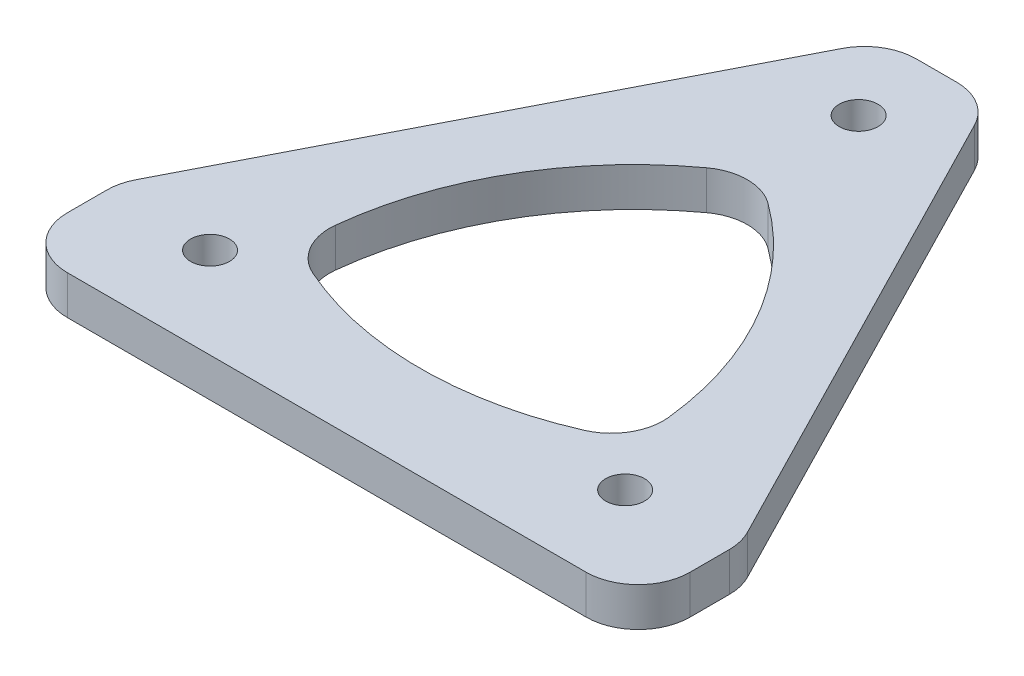
ISO-10303-21;
HEADER;
FILE_DESCRIPTION(('STEP AP214'),'2;1');
FILE_NAME('part.step','',(''),(''),'','','');
FILE_SCHEMA(('AUTOMOTIVE_DESIGN { 1 0 10303 214 1 1 1 1 }'));
ENDSEC;
DATA;
#1=APPLICATION_CONTEXT('core data for automotive mechanical design processes');
#2=APPLICATION_PROTOCOL_DEFINITION('international standard','automotive_design',2000,#1);
#3=PRODUCT_CONTEXT('',#1,'mechanical');
#4=PRODUCT('Part','Part','',(#3));
#5=PRODUCT_RELATED_PRODUCT_CATEGORY('part','',(#4));
#6=PRODUCT_DEFINITION_FORMATION('','',#4);
#7=PRODUCT_DEFINITION_CONTEXT('part definition',#1,'design');
#8=PRODUCT_DEFINITION('design','',#6,#7);
#9=PRODUCT_DEFINITION_SHAPE('','',#8);
#10=(LENGTH_UNIT() NAMED_UNIT(*) SI_UNIT(.MILLI.,.METRE.));
#11=(NAMED_UNIT(*) PLANE_ANGLE_UNIT() SI_UNIT($,.RADIAN.));
#12=(NAMED_UNIT(*) SI_UNIT($,.STERADIAN.) SOLID_ANGLE_UNIT());
#13=UNCERTAINTY_MEASURE_WITH_UNIT(LENGTH_MEASURE(1.E-05),#10,'distance_accuracy_value','');
#14=(GEOMETRIC_REPRESENTATION_CONTEXT(3) GLOBAL_UNCERTAINTY_ASSIGNED_CONTEXT((#13)) GLOBAL_UNIT_ASSIGNED_CONTEXT((#10,
#11,#12)) REPRESENTATION_CONTEXT('',''));
#15=CARTESIAN_POINT('',(0.,0.,0.));
#16=DIRECTION('',(0.,0.,1.));
#17=DIRECTION('',(1.,0.,0.));
#18=AXIS2_PLACEMENT_3D('',#15,#16,#17);
#19=CARTESIAN_POINT('',(-20.,3.,-4.));
#20=DIRECTION('',(0.,-1.,0.));
#21=DIRECTION('',(0.,0.,-1.));
#22=AXIS2_PLACEMENT_3D('',#19,#20,#21);
#23=PLANE('',#22);
#24=CARTESIAN_POINT('',(0.,3.,-33.1908532848341));
#25=DIRECTION('',(0.,1.,0.));
#26=DIRECTION('',(0.,0.,1.));
#27=AXIS2_PLACEMENT_3D('',#24,#25,#26);
#28=CIRCLE('',#27,25.9807621135332);
#29=CARTESIAN_POINT('',(-10.4731291784257,3.,-9.41452965791463));
#30=VERTEX_POINT('',#29);
#31=CARTESIAN_POINT('',(10.4731291784257,3.,-9.41452965791463));
#32=VERTEX_POINT('',#31);
#33=EDGE_CURVE('E227',#30,#32,#28,.T.);
#34=ORIENTED_EDGE('',*,*,#33,.F.);
#35=CARTESIAN_POINT('',(-8.86068545831319,3.,-13.0751341502724));
#36=DIRECTION('',(0.,-1.,0.));
#37=DIRECTION('',(0.,0.,-1.));
#38=AXIS2_PLACEMENT_3D('',#35,#36,#37);
#39=CIRCLE('',#38,4.);
#40=CARTESIAN_POINT('',(-12.8370838019587,3.,-13.5090191726612));
#41=VERTEX_POINT('',#40);
#42=EDGE_CURVE('E209',#30,#41,#39,.T.);
#43=ORIENTED_EDGE('',*,*,#42,.T.);
#44=CARTESIAN_POINT('',(12.9903810567666,3.,-10.6908532848341));
#45=DIRECTION('',(0.,1.,0.));
#46=DIRECTION('',(0.,0.,1.));
#47=AXIS2_PLACEMENT_3D('',#44,#45,#46);
#48=CIRCLE('',#47,25.9807621135332);
#49=CARTESIAN_POINT('',(-2.36395462353303,3.,-31.6490110239265));
#50=VERTEX_POINT('',#49);
#51=EDGE_CURVE('E218',#50,#41,#48,.T.);
#52=ORIENTED_EDGE('',*,*,#51,.F.);
#53=CARTESIAN_POINT('',(0.,3.,-28.4222915539575));
#54=DIRECTION('',(0.,-1.,0.));
#55=DIRECTION('',(0.,0.,-1.));
#56=AXIS2_PLACEMENT_3D('',#53,#54,#55);
#57=CIRCLE('',#56,4.);
#58=CARTESIAN_POINT('',(2.36395462353303,3.,-31.6490110239265));
#59=VERTEX_POINT('',#58);
#60=EDGE_CURVE('E45',#50,#59,#57,.T.);
#61=ORIENTED_EDGE('',*,*,#60,.T.);
#62=CARTESIAN_POINT('',(-12.9903810567666,3.,-10.6908532848341));
#63=DIRECTION('',(0.,1.,0.));
#64=DIRECTION('',(0.,0.,1.));
#65=AXIS2_PLACEMENT_3D('',#62,#63,#64);
#66=CIRCLE('',#65,25.9807621135332);
#67=CARTESIAN_POINT('',(12.8370838019587,3.,-13.5090191726612));
#68=VERTEX_POINT('',#67);
#69=EDGE_CURVE('E217',#68,#59,#66,.T.);
#70=ORIENTED_EDGE('',*,*,#69,.F.);
#71=CARTESIAN_POINT('',(8.86068545831319,3.,-13.0751341502724));
#72=DIRECTION('',(0.,-1.,0.));
#73=DIRECTION('',(0.,0.,-1.));
#74=AXIS2_PLACEMENT_3D('',#71,#72,#73);
#75=CIRCLE('',#74,4.);
#76=EDGE_CURVE('E205',#68,#32,#75,.T.);
#77=ORIENTED_EDGE('',*,*,#76,.T.);
#78=EDGE_LOOP('',(#34,#43,#52,#61,#70,#77));
#79=FACE_BOUND('',#78,.T.);
#80=DIRECTION('',(1.,0.,0.));
#81=VECTOR('',#80,1.);
#82=CARTESIAN_POINT('',(20.,3.,0.));
#83=LINE('',#82,#81);
#84=CARTESIAN_POINT('',(-20.,3.,0.));
#85=VERTEX_POINT('',#84);
#86=CARTESIAN_POINT('',(20.,3.,0.));
#87=VERTEX_POINT('',#86);
#88=EDGE_CURVE('E172',#85,#87,#83,.T.);
#89=ORIENTED_EDGE('',*,*,#88,.T.);
#90=CARTESIAN_POINT('',(20.,3.,-4.));
#91=DIRECTION('',(0.,1.,0.));
#92=DIRECTION('',(0.,0.,-1.));
#93=AXIS2_PLACEMENT_3D('',#90,#91,#92);
#94=CIRCLE('',#93,4.);
#95=CARTESIAN_POINT('',(24.,3.,-4.));
#96=VERTEX_POINT('',#95);
#97=EDGE_CURVE('E162',#87,#96,#94,.T.);
#98=ORIENTED_EDGE('',*,*,#97,.T.);
#99=DIRECTION('',(0.,0.,-1.));
#100=VECTOR('',#99,1.);
#101=CARTESIAN_POINT('',(24.,3.,-7.03415719967555));
#102=LINE('',#101,#100);
#103=CARTESIAN_POINT('',(24.,3.,-7.03415719967555));
#104=VERTEX_POINT('',#103);
#105=EDGE_CURVE('E171',#96,#104,#102,.T.);
#106=ORIENTED_EDGE('',*,*,#105,.T.);
#107=CARTESIAN_POINT('',(20.,3.,-7.03415719967555));
#108=DIRECTION('',(0.,1.,0.));
#109=DIRECTION('',(0.,0.,-1.));
#110=AXIS2_PLACEMENT_3D('',#107,#108,#109);
#111=CIRCLE('',#110,4.);
#112=CARTESIAN_POINT('',(23.5592698512509,3.,-8.85942379006065));
#113=VERTEX_POINT('',#112);
#114=EDGE_CURVE('E261',#104,#113,#111,.T.);
#115=ORIENTED_EDGE('',*,*,#114,.T.);
#116=DIRECTION('',(-0.456316647596275,0.,-0.889817462812737));
#117=VECTOR('',#116,1.);
#118=CARTESIAN_POINT('',(5.11524790236662,3.,-44.8252665903851));
#119=LINE('',#118,#117);
#120=CARTESIAN_POINT('',(5.11524790236662,3.,-44.8252665903851));
#121=VERTEX_POINT('',#120);
#122=EDGE_CURVE('E263',#113,#121,#119,.T.);
#123=ORIENTED_EDGE('',*,*,#122,.T.);
#124=CARTESIAN_POINT('',(1.55597805111567,3.,-43.));
#125=DIRECTION('',(0.,1.,0.));
#126=DIRECTION('',(0.,0.,-1.));
#127=AXIS2_PLACEMENT_3D('',#124,#125,#126);
#128=CIRCLE('',#127,4.);
#129=CARTESIAN_POINT('',(1.55597805111567,3.,-47.));
#130=VERTEX_POINT('',#129);
#131=EDGE_CURVE('E265',#121,#130,#128,.T.);
#132=ORIENTED_EDGE('',*,*,#131,.T.);
#133=DIRECTION('',(-1.,0.,0.));
#134=VECTOR('',#133,1.);
#135=CARTESIAN_POINT('',(-1.55597805111567,3.,-47.));
#136=LINE('',#135,#134);
#137=CARTESIAN_POINT('',(-1.55597805111567,3.,-47.));
#138=VERTEX_POINT('',#137);
#139=EDGE_CURVE('E267',#130,#138,#136,.T.);
#140=ORIENTED_EDGE('',*,*,#139,.T.);
#141=CARTESIAN_POINT('',(-1.55597805111567,3.,-43.));
#142=DIRECTION('',(0.,1.,0.));
#143=DIRECTION('',(0.,0.,-1.));
#144=AXIS2_PLACEMENT_3D('',#141,#142,#143);
#145=CIRCLE('',#144,4.);
#146=CARTESIAN_POINT('',(-5.11524790236662,3.,-44.8252665903851));
#147=VERTEX_POINT('',#146);
#148=EDGE_CURVE('E269',#138,#147,#145,.T.);
#149=ORIENTED_EDGE('',*,*,#148,.T.);
#150=DIRECTION('',(-0.456316647596275,0.,0.889817462812737));
#151=VECTOR('',#150,1.);
#152=CARTESIAN_POINT('',(-23.5592698512509,3.,-8.85942379006065));
#153=LINE('',#152,#151);
#154=CARTESIAN_POINT('',(-23.5592698512509,3.,-8.85942379006065));
#155=VERTEX_POINT('',#154);
#156=EDGE_CURVE('E271',#147,#155,#153,.T.);
#157=ORIENTED_EDGE('',*,*,#156,.T.);
#158=CARTESIAN_POINT('',(-20.,3.,-7.03415719967555));
#159=DIRECTION('',(0.,1.,0.));
#160=DIRECTION('',(0.,0.,-1.));
#161=AXIS2_PLACEMENT_3D('',#158,#159,#160);
#162=CIRCLE('',#161,4.);
#163=CARTESIAN_POINT('',(-24.,3.,-7.03415719967555));
#164=VERTEX_POINT('',#163);
#165=EDGE_CURVE('E273',#155,#164,#162,.T.);
#166=ORIENTED_EDGE('',*,*,#165,.T.);
#167=DIRECTION('',(0.,0.,1.));
#168=VECTOR('',#167,1.);
#169=CARTESIAN_POINT('',(-24.,3.,-4.));
#170=LINE('',#169,#168);
#171=CARTESIAN_POINT('',(-24.,3.,-4.));
#172=VERTEX_POINT('',#171);
#173=EDGE_CURVE('E275',#164,#172,#170,.T.);
#174=ORIENTED_EDGE('',*,*,#173,.T.);
#175=CARTESIAN_POINT('',(-20.,3.,-4.));
#176=DIRECTION('',(0.,1.,0.));
#177=DIRECTION('',(0.,0.,-1.));
#178=AXIS2_PLACEMENT_3D('',#175,#176,#177);
#179=CIRCLE('',#178,4.);
#180=EDGE_CURVE('E177',#172,#85,#179,.T.);
#181=ORIENTED_EDGE('',*,*,#180,.T.);
#182=EDGE_LOOP('',(#89,#98,#106,#115,#123,#132,#140,#149,#157,#166,#174,#181));
#183=FACE_BOUND('',#182,.T.);
#184=CARTESIAN_POINT('',(-16.,3.,-7.));
#185=DIRECTION('',(0.,1.,0.));
#186=DIRECTION('',(0.,0.,1.));
#187=AXIS2_PLACEMENT_3D('',#184,#185,#186);
#188=CIRCLE('',#187,1.5);
#189=CARTESIAN_POINT('',(-16.,3.,-5.5));
#190=VERTEX_POINT('',#189);
#191=EDGE_CURVE('E254',#190,#190,#188,.T.);
#192=ORIENTED_EDGE('',*,*,#191,.F.);
#193=EDGE_LOOP('',(#192));
#194=FACE_BOUND('',#193,.T.);
#195=CARTESIAN_POINT('',(0.,3.,-41.));
#196=DIRECTION('',(0.,1.,0.));
#197=DIRECTION('',(0.,0.,1.));
#198=AXIS2_PLACEMENT_3D('',#195,#196,#197);
#199=CIRCLE('',#198,1.5);
#200=CARTESIAN_POINT('',(0.,3.,-39.5));
#201=VERTEX_POINT('',#200);
#202=EDGE_CURVE('E248',#201,#201,#199,.T.);
#203=ORIENTED_EDGE('',*,*,#202,.F.);
#204=EDGE_LOOP('',(#203));
#205=FACE_BOUND('',#204,.T.);
#206=CARTESIAN_POINT('',(16.,3.,-7.));
#207=DIRECTION('',(0.,1.,0.));
#208=DIRECTION('',(0.,0.,1.));
#209=AXIS2_PLACEMENT_3D('',#206,#207,#208);
#210=CIRCLE('',#209,1.5);
#211=CARTESIAN_POINT('',(16.,3.,-5.5));
#212=VERTEX_POINT('',#211);
#213=EDGE_CURVE('E242',#212,#212,#210,.T.);
#214=ORIENTED_EDGE('',*,*,#213,.F.);
#215=EDGE_LOOP('',(#214));
#216=FACE_BOUND('',#215,.T.);
#217=ADVANCED_FACE('F37',(#79,#183,#194,#205,#216),#23,.F.);
#218=CARTESIAN_POINT('',(-20.,0.,-4.));
#219=DIRECTION('',(0.,-1.,0.));
#220=DIRECTION('',(0.,0.,-1.));
#221=AXIS2_PLACEMENT_3D('',#218,#219,#220);
#222=PLANE('',#221);
#223=CARTESIAN_POINT('',(-12.9903810567666,0.,-10.6908532848341));
#224=DIRECTION('',(0.,1.,0.));
#225=DIRECTION('',(0.,0.,1.));
#226=AXIS2_PLACEMENT_3D('',#223,#224,#225);
#227=CIRCLE('',#226,25.9807621135332);
#228=CARTESIAN_POINT('',(12.8370838019587,0.,-13.5090191726612));
#229=VERTEX_POINT('',#228);
#230=CARTESIAN_POINT('',(2.36395462353303,0.,-31.6490110239265));
#231=VERTEX_POINT('',#230);
#232=EDGE_CURVE('E234',#229,#231,#227,.T.);
#233=ORIENTED_EDGE('',*,*,#232,.T.);
#234=CARTESIAN_POINT('',(0.,0.,-28.4222915539575));
#235=DIRECTION('',(0.,-1.,0.));
#236=DIRECTION('',(0.,0.,-1.));
#237=AXIS2_PLACEMENT_3D('',#234,#235,#236);
#238=CIRCLE('',#237,4.);
#239=CARTESIAN_POINT('',(-2.36395462353303,0.,-31.6490110239265));
#240=VERTEX_POINT('',#239);
#241=EDGE_CURVE('E11',#231,#240,#238,.F.);
#242=ORIENTED_EDGE('',*,*,#241,.T.);
#243=CARTESIAN_POINT('',(12.9903810567666,0.,-10.6908532848341));
#244=DIRECTION('',(0.,1.,0.));
#245=DIRECTION('',(0.,0.,1.));
#246=AXIS2_PLACEMENT_3D('',#243,#244,#245);
#247=CIRCLE('',#246,25.9807621135332);
#248=CARTESIAN_POINT('',(-12.8370838019587,0.,-13.5090191726612));
#249=VERTEX_POINT('',#248);
#250=EDGE_CURVE('E226',#240,#249,#247,.T.);
#251=ORIENTED_EDGE('',*,*,#250,.T.);
#252=CARTESIAN_POINT('',(-8.86068545831319,0.,-13.0751341502724));
#253=DIRECTION('',(0.,-1.,0.));
#254=DIRECTION('',(0.,0.,-1.));
#255=AXIS2_PLACEMENT_3D('',#252,#253,#254);
#256=CIRCLE('',#255,4.);
#257=CARTESIAN_POINT('',(-10.4731291784257,0.,-9.41452965791463));
#258=VERTEX_POINT('',#257);
#259=EDGE_CURVE('E211',#249,#258,#256,.F.);
#260=ORIENTED_EDGE('',*,*,#259,.T.);
#261=CARTESIAN_POINT('',(0.,0.,-33.1908532848341));
#262=DIRECTION('',(0.,1.,0.));
#263=DIRECTION('',(0.,0.,1.));
#264=AXIS2_PLACEMENT_3D('',#261,#262,#263);
#265=CIRCLE('',#264,25.9807621135332);
#266=CARTESIAN_POINT('',(10.4731291784257,0.,-9.41452965791463));
#267=VERTEX_POINT('',#266);
#268=EDGE_CURVE('E231',#258,#267,#265,.T.);
#269=ORIENTED_EDGE('',*,*,#268,.T.);
#270=CARTESIAN_POINT('',(8.86068545831319,0.,-13.0751341502724));
#271=DIRECTION('',(0.,-1.,0.));
#272=DIRECTION('',(0.,0.,-1.));
#273=AXIS2_PLACEMENT_3D('',#270,#271,#272);
#274=CIRCLE('',#273,4.);
#275=EDGE_CURVE('E207',#267,#229,#274,.F.);
#276=ORIENTED_EDGE('',*,*,#275,.T.);
#277=EDGE_LOOP('',(#233,#242,#251,#260,#269,#276));
#278=FACE_BOUND('',#277,.T.);
#279=CARTESIAN_POINT('',(0.,0.,-41.));
#280=DIRECTION('',(0.,1.,0.));
#281=DIRECTION('',(0.,0.,1.));
#282=AXIS2_PLACEMENT_3D('',#279,#280,#281);
#283=CIRCLE('',#282,1.5);
#284=CARTESIAN_POINT('',(0.,0.,-39.5));
#285=VERTEX_POINT('',#284);
#286=EDGE_CURVE('E245',#285,#285,#283,.T.);
#287=ORIENTED_EDGE('',*,*,#286,.T.);
#288=EDGE_LOOP('',(#287));
#289=FACE_BOUND('',#288,.T.);
#290=CARTESIAN_POINT('',(20.,0.,-4.));
#291=DIRECTION('',(0.,1.,0.));
#292=DIRECTION('',(0.,0.,-1.));
#293=AXIS2_PLACEMENT_3D('',#290,#291,#292);
#294=CIRCLE('',#293,4.);
#295=CARTESIAN_POINT('',(20.,0.,0.));
#296=VERTEX_POINT('',#295);
#297=CARTESIAN_POINT('',(24.,0.,-4.));
#298=VERTEX_POINT('',#297);
#299=EDGE_CURVE('E257',#296,#298,#294,.T.);
#300=ORIENTED_EDGE('',*,*,#299,.F.);
#301=DIRECTION('',(1.,0.,0.));
#302=VECTOR('',#301,1.);
#303=CARTESIAN_POINT('',(0.,0.,0.));
#304=LINE('',#303,#302);
#305=CARTESIAN_POINT('',(-20.,0.,0.));
#306=VERTEX_POINT('',#305);
#307=EDGE_CURVE('E181',#306,#296,#304,.T.);
#308=ORIENTED_EDGE('',*,*,#307,.F.);
#309=CARTESIAN_POINT('',(-20.,0.,-4.));
#310=DIRECTION('',(0.,1.,0.));
#311=DIRECTION('',(0.,0.,-1.));
#312=AXIS2_PLACEMENT_3D('',#309,#310,#311);
#313=CIRCLE('',#312,4.);
#314=CARTESIAN_POINT('',(-24.,0.,-4.));
#315=VERTEX_POINT('',#314);
#316=EDGE_CURVE('E298',#315,#306,#313,.T.);
#317=ORIENTED_EDGE('',*,*,#316,.F.);
#318=DIRECTION('',(0.,0.,1.));
#319=VECTOR('',#318,1.);
#320=CARTESIAN_POINT('',(-24.,0.,-4.));
#321=LINE('',#320,#319);
#322=CARTESIAN_POINT('',(-24.,0.,-7.03415719967555));
#323=VERTEX_POINT('',#322);
#324=EDGE_CURVE('E296',#323,#315,#321,.T.);
#325=ORIENTED_EDGE('',*,*,#324,.F.);
#326=CARTESIAN_POINT('',(-20.,0.,-7.03415719967555));
#327=DIRECTION('',(0.,1.,0.));
#328=DIRECTION('',(0.,0.,-1.));
#329=AXIS2_PLACEMENT_3D('',#326,#327,#328);
#330=CIRCLE('',#329,4.);
#331=CARTESIAN_POINT('',(-23.5592698512509,0.,-8.85942379006065));
#332=VERTEX_POINT('',#331);
#333=EDGE_CURVE('E294',#332,#323,#330,.T.);
#334=ORIENTED_EDGE('',*,*,#333,.F.);
#335=DIRECTION('',(-0.456316647596275,0.,0.889817462812737));
#336=VECTOR('',#335,1.);
#337=CARTESIAN_POINT('',(-23.5592698512509,0.,-8.85942379006065));
#338=LINE('',#337,#336);
#339=CARTESIAN_POINT('',(-5.11524790236662,0.,-44.8252665903851));
#340=VERTEX_POINT('',#339);
#341=EDGE_CURVE('E292',#340,#332,#338,.T.);
#342=ORIENTED_EDGE('',*,*,#341,.F.);
#343=CARTESIAN_POINT('',(-1.55597805111567,0.,-43.));
#344=DIRECTION('',(0.,1.,0.));
#345=DIRECTION('',(0.,0.,-1.));
#346=AXIS2_PLACEMENT_3D('',#343,#344,#345);
#347=CIRCLE('',#346,4.);
#348=CARTESIAN_POINT('',(-1.55597805111567,0.,-47.));
#349=VERTEX_POINT('',#348);
#350=EDGE_CURVE('E290',#349,#340,#347,.T.);
#351=ORIENTED_EDGE('',*,*,#350,.F.);
#352=DIRECTION('',(-1.,0.,0.));
#353=VECTOR('',#352,1.);
#354=CARTESIAN_POINT('',(-1.55597805111567,0.,-47.));
#355=LINE('',#354,#353);
#356=CARTESIAN_POINT('',(1.55597805111567,0.,-47.));
#357=VERTEX_POINT('',#356);
#358=EDGE_CURVE('E288',#357,#349,#355,.T.);
#359=ORIENTED_EDGE('',*,*,#358,.F.);
#360=CARTESIAN_POINT('',(1.55597805111567,0.,-43.));
#361=DIRECTION('',(0.,1.,0.));
#362=DIRECTION('',(0.,0.,-1.));
#363=AXIS2_PLACEMENT_3D('',#360,#361,#362);
#364=CIRCLE('',#363,4.);
#365=CARTESIAN_POINT('',(5.11524790236662,0.,-44.8252665903851));
#366=VERTEX_POINT('',#365);
#367=EDGE_CURVE('E286',#366,#357,#364,.T.);
#368=ORIENTED_EDGE('',*,*,#367,.F.);
#369=DIRECTION('',(-0.456316647596275,0.,-0.889817462812737));
#370=VECTOR('',#369,1.);
#371=CARTESIAN_POINT('',(5.11524790236662,0.,-44.8252665903851));
#372=LINE('',#371,#370);
#373=CARTESIAN_POINT('',(23.5592698512509,0.,-8.85942379006065));
#374=VERTEX_POINT('',#373);
#375=EDGE_CURVE('E284',#374,#366,#372,.T.);
#376=ORIENTED_EDGE('',*,*,#375,.F.);
#377=CARTESIAN_POINT('',(20.,0.,-7.03415719967555));
#378=DIRECTION('',(0.,1.,0.));
#379=DIRECTION('',(0.,0.,-1.));
#380=AXIS2_PLACEMENT_3D('',#377,#378,#379);
#381=CIRCLE('',#380,4.);
#382=CARTESIAN_POINT('',(24.,0.,-7.03415719967555));
#383=VERTEX_POINT('',#382);
#384=EDGE_CURVE('E282',#383,#374,#381,.T.);
#385=ORIENTED_EDGE('',*,*,#384,.F.);
#386=DIRECTION('',(0.,0.,-1.));
#387=VECTOR('',#386,1.);
#388=CARTESIAN_POINT('',(24.,0.,-7.03415719967555));
#389=LINE('',#388,#387);
#390=EDGE_CURVE('E280',#298,#383,#389,.T.);
#391=ORIENTED_EDGE('',*,*,#390,.F.);
#392=EDGE_LOOP('',(#300,#308,#317,#325,#334,#342,#351,#359,#368,#376,#385,#391));
#393=FACE_BOUND('',#392,.T.);
#394=CARTESIAN_POINT('',(-16.,0.,-7.));
#395=DIRECTION('',(0.,1.,0.));
#396=DIRECTION('',(0.,0.,1.));
#397=AXIS2_PLACEMENT_3D('',#394,#395,#396);
#398=CIRCLE('',#397,1.5);
#399=CARTESIAN_POINT('',(-16.,0.,-5.5));
#400=VERTEX_POINT('',#399);
#401=EDGE_CURVE('E251',#400,#400,#398,.T.);
#402=ORIENTED_EDGE('',*,*,#401,.T.);
#403=EDGE_LOOP('',(#402));
#404=FACE_BOUND('',#403,.T.);
#405=CARTESIAN_POINT('',(16.,0.,-7.));
#406=DIRECTION('',(0.,1.,0.));
#407=DIRECTION('',(0.,0.,1.));
#408=AXIS2_PLACEMENT_3D('',#405,#406,#407);
#409=CIRCLE('',#408,1.5);
#410=CARTESIAN_POINT('',(16.,0.,-5.5));
#411=VERTEX_POINT('',#410);
#412=EDGE_CURVE('E238',#411,#411,#409,.T.);
#413=ORIENTED_EDGE('',*,*,#412,.T.);
#414=EDGE_LOOP('',(#413));
#415=FACE_BOUND('',#414,.T.);
#416=ADVANCED_FACE('F336',(#278,#289,#393,#404,#415),#222,.T.);
#417=CARTESIAN_POINT('',(20.,3.,-4.));
#418=DIRECTION('',(0.,-1.,0.));
#419=DIRECTION('',(0.,0.,-1.));
#420=AXIS2_PLACEMENT_3D('',#417,#418,#419);
#421=CYLINDRICAL_SURFACE('',#420,4.);
#422=ORIENTED_EDGE('',*,*,#299,.T.);
#423=DIRECTION('',(0.,-1.,0.));
#424=VECTOR('',#423,1.);
#425=CARTESIAN_POINT('',(24.,3.,-4.));
#426=LINE('',#425,#424);
#427=EDGE_CURVE('E168',#96,#298,#426,.T.);
#428=ORIENTED_EDGE('',*,*,#427,.F.);
#429=ORIENTED_EDGE('',*,*,#97,.F.);
#430=DIRECTION('',(0.,-1.,0.));
#431=VECTOR('',#430,1.);
#432=CARTESIAN_POINT('',(20.,3.,0.));
#433=LINE('',#432,#431);
#434=EDGE_CURVE('E166',#87,#296,#433,.T.);
#435=ORIENTED_EDGE('',*,*,#434,.T.);
#436=EDGE_LOOP('',(#422,#428,#429,#435));
#437=FACE_BOUND('',#436,.T.);
#438=ADVANCED_FACE('F164',(#437),#421,.T.);
#439=CARTESIAN_POINT('',(24.,3.,-7.03415719967555));
#440=DIRECTION('',(-1.,0.,0.));
#441=DIRECTION('',(0.,0.,1.));
#442=AXIS2_PLACEMENT_3D('',#439,#440,#441);
#443=PLANE('',#442);
#444=ORIENTED_EDGE('',*,*,#390,.T.);
#445=DIRECTION('',(0.,-1.,0.));
#446=VECTOR('',#445,1.);
#447=CARTESIAN_POINT('',(24.,3.,-7.03415719967555));
#448=LINE('',#447,#446);
#449=EDGE_CURVE('E190',#104,#383,#448,.T.);
#450=ORIENTED_EDGE('',*,*,#449,.F.);
#451=ORIENTED_EDGE('',*,*,#105,.F.);
#452=ORIENTED_EDGE('',*,*,#427,.T.);
#453=EDGE_LOOP('',(#444,#450,#451,#452));
#454=FACE_BOUND('',#453,.T.);
#455=ADVANCED_FACE('F350',(#454),#443,.F.);
#456=CARTESIAN_POINT('',(20.,3.,-7.03415719967555));
#457=DIRECTION('',(0.,-1.,0.));
#458=DIRECTION('',(0.,0.,-1.));
#459=AXIS2_PLACEMENT_3D('',#456,#457,#458);
#460=CYLINDRICAL_SURFACE('',#459,4.);
#461=ORIENTED_EDGE('',*,*,#384,.T.);
#462=DIRECTION('',(0.,-1.,0.));
#463=VECTOR('',#462,1.);
#464=CARTESIAN_POINT('',(23.5592698512509,3.,-8.85942379006065));
#465=LINE('',#464,#463);
#466=EDGE_CURVE('E323',#113,#374,#465,.T.);
#467=ORIENTED_EDGE('',*,*,#466,.F.);
#468=ORIENTED_EDGE('',*,*,#114,.F.);
#469=ORIENTED_EDGE('',*,*,#449,.T.);
#470=EDGE_LOOP('',(#461,#467,#468,#469));
#471=FACE_BOUND('',#470,.T.);
#472=ADVANCED_FACE('F330',(#471),#460,.T.);
#473=CARTESIAN_POINT('',(5.11524790236662,3.,-44.8252665903851));
#474=DIRECTION('',(-0.889817462812737,0.,0.456316647596275));
#475=DIRECTION('',(0.456316647596275,0.,0.889817462812737));
#476=AXIS2_PLACEMENT_3D('',#473,#474,#475);
#477=PLANE('',#476);
#478=ORIENTED_EDGE('',*,*,#375,.T.);
#479=DIRECTION('',(0.,-1.,0.));
#480=VECTOR('',#479,1.);
#481=CARTESIAN_POINT('',(5.11524790236662,3.,-44.8252665903851));
#482=LINE('',#481,#480);
#483=EDGE_CURVE('E320',#121,#366,#482,.T.);
#484=ORIENTED_EDGE('',*,*,#483,.F.);
#485=ORIENTED_EDGE('',*,*,#122,.F.);
#486=ORIENTED_EDGE('',*,*,#466,.T.);
#487=EDGE_LOOP('',(#478,#484,#485,#486));
#488=FACE_BOUND('',#487,.T.);
#489=ADVANCED_FACE('F342',(#488),#477,.F.);
#490=CARTESIAN_POINT('',(1.55597805111567,3.,-43.));
#491=DIRECTION('',(0.,-1.,0.));
#492=DIRECTION('',(0.,0.,-1.));
#493=AXIS2_PLACEMENT_3D('',#490,#491,#492);
#494=CYLINDRICAL_SURFACE('',#493,4.);
#495=ORIENTED_EDGE('',*,*,#367,.T.);
#496=DIRECTION('',(0.,-1.,0.));
#497=VECTOR('',#496,1.);
#498=CARTESIAN_POINT('',(1.55597805111567,3.,-47.));
#499=LINE('',#498,#497);
#500=EDGE_CURVE('E317',#130,#357,#499,.T.);
#501=ORIENTED_EDGE('',*,*,#500,.F.);
#502=ORIENTED_EDGE('',*,*,#131,.F.);
#503=ORIENTED_EDGE('',*,*,#483,.T.);
#504=EDGE_LOOP('',(#495,#501,#502,#503));
#505=FACE_BOUND('',#504,.T.);
#506=ADVANCED_FACE('F346',(#505),#494,.T.);
#507=CARTESIAN_POINT('',(-1.55597805111567,3.,-47.));
#508=DIRECTION('',(0.,0.,1.));
#509=DIRECTION('',(1.,0.,0.));
#510=AXIS2_PLACEMENT_3D('',#507,#508,#509);
#511=PLANE('',#510);
#512=ORIENTED_EDGE('',*,*,#358,.T.);
#513=DIRECTION('',(0.,-1.,0.));
#514=VECTOR('',#513,1.);
#515=CARTESIAN_POINT('',(-1.55597805111567,3.,-47.));
#516=LINE('',#515,#514);
#517=EDGE_CURVE('E314',#138,#349,#516,.T.);
#518=ORIENTED_EDGE('',*,*,#517,.F.);
#519=ORIENTED_EDGE('',*,*,#139,.F.);
#520=ORIENTED_EDGE('',*,*,#500,.T.);
#521=EDGE_LOOP('',(#512,#518,#519,#520));
#522=FACE_BOUND('',#521,.T.);
#523=ADVANCED_FACE('F390',(#522),#511,.F.);
#524=CARTESIAN_POINT('',(-1.55597805111567,3.,-43.));
#525=DIRECTION('',(0.,-1.,0.));
#526=DIRECTION('',(0.,0.,-1.));
#527=AXIS2_PLACEMENT_3D('',#524,#525,#526);
#528=CYLINDRICAL_SURFACE('',#527,4.);
#529=ORIENTED_EDGE('',*,*,#350,.T.);
#530=DIRECTION('',(0.,-1.,0.));
#531=VECTOR('',#530,1.);
#532=CARTESIAN_POINT('',(-5.11524790236662,3.,-44.8252665903851));
#533=LINE('',#532,#531);
#534=EDGE_CURVE('E311',#147,#340,#533,.T.);
#535=ORIENTED_EDGE('',*,*,#534,.F.);
#536=ORIENTED_EDGE('',*,*,#148,.F.);
#537=ORIENTED_EDGE('',*,*,#517,.T.);
#538=EDGE_LOOP('',(#529,#535,#536,#537));
#539=FACE_BOUND('',#538,.T.);
#540=ADVANCED_FACE('F386',(#539),#528,.T.);
#541=CARTESIAN_POINT('',(-23.5592698512509,3.,-8.85942379006065));
#542=DIRECTION('',(0.889817462812737,0.,0.456316647596275));
#543=DIRECTION('',(0.456316647596276,0.,-0.889817462812737));
#544=AXIS2_PLACEMENT_3D('',#541,#542,#543);
#545=PLANE('',#544);
#546=ORIENTED_EDGE('',*,*,#341,.T.);
#547=DIRECTION('',(0.,-1.,0.));
#548=VECTOR('',#547,1.);
#549=CARTESIAN_POINT('',(-23.5592698512509,3.,-8.85942379006065));
#550=LINE('',#549,#548);
#551=EDGE_CURVE('E308',#155,#332,#550,.T.);
#552=ORIENTED_EDGE('',*,*,#551,.F.);
#553=ORIENTED_EDGE('',*,*,#156,.F.);
#554=ORIENTED_EDGE('',*,*,#534,.T.);
#555=EDGE_LOOP('',(#546,#552,#553,#554));
#556=FACE_BOUND('',#555,.T.);
#557=ADVANCED_FACE('F382',(#556),#545,.F.);
#558=CARTESIAN_POINT('',(-20.,3.,-7.03415719967555));
#559=DIRECTION('',(0.,-1.,0.));
#560=DIRECTION('',(0.,0.,-1.));
#561=AXIS2_PLACEMENT_3D('',#558,#559,#560);
#562=CYLINDRICAL_SURFACE('',#561,4.);
#563=ORIENTED_EDGE('',*,*,#333,.T.);
#564=DIRECTION('',(0.,-1.,0.));
#565=VECTOR('',#564,1.);
#566=CARTESIAN_POINT('',(-24.,3.,-7.03415719967555));
#567=LINE('',#566,#565);
#568=EDGE_CURVE('E305',#164,#323,#567,.T.);
#569=ORIENTED_EDGE('',*,*,#568,.F.);
#570=ORIENTED_EDGE('',*,*,#165,.F.);
#571=ORIENTED_EDGE('',*,*,#551,.T.);
#572=EDGE_LOOP('',(#563,#569,#570,#571));
#573=FACE_BOUND('',#572,.T.);
#574=ADVANCED_FACE('F378',(#573),#562,.T.);
#575=CARTESIAN_POINT('',(-24.,3.,-4.));
#576=DIRECTION('',(1.,0.,0.));
#577=DIRECTION('',(0.,0.,-1.));
#578=AXIS2_PLACEMENT_3D('',#575,#576,#577);
#579=PLANE('',#578);
#580=ORIENTED_EDGE('',*,*,#324,.T.);
#581=DIRECTION('',(0.,-1.,0.));
#582=VECTOR('',#581,1.);
#583=CARTESIAN_POINT('',(-24.,3.,-4.));
#584=LINE('',#583,#582);
#585=EDGE_CURVE('E302',#172,#315,#584,.T.);
#586=ORIENTED_EDGE('',*,*,#585,.F.);
#587=ORIENTED_EDGE('',*,*,#173,.F.);
#588=ORIENTED_EDGE('',*,*,#568,.T.);
#589=EDGE_LOOP('',(#580,#586,#587,#588));
#590=FACE_BOUND('',#589,.T.);
#591=ADVANCED_FACE('F374',(#590),#579,.F.);
#592=CARTESIAN_POINT('',(-20.,3.,-4.));
#593=DIRECTION('',(0.,-1.,0.));
#594=DIRECTION('',(0.,0.,-1.));
#595=AXIS2_PLACEMENT_3D('',#592,#593,#594);
#596=CYLINDRICAL_SURFACE('',#595,4.);
#597=ORIENTED_EDGE('',*,*,#316,.T.);
#598=DIRECTION('',(0.,-1.,0.));
#599=VECTOR('',#598,1.);
#600=CARTESIAN_POINT('',(-20.,3.,0.));
#601=LINE('',#600,#599);
#602=EDGE_CURVE('E278',#85,#306,#601,.T.);
#603=ORIENTED_EDGE('',*,*,#602,.F.);
#604=ORIENTED_EDGE('',*,*,#180,.F.);
#605=ORIENTED_EDGE('',*,*,#585,.T.);
#606=EDGE_LOOP('',(#597,#603,#604,#605));
#607=FACE_BOUND('',#606,.T.);
#608=ADVANCED_FACE('F371',(#607),#596,.T.);
#609=CARTESIAN_POINT('',(0.,3.,0.));
#610=DIRECTION('',(0.,0.,-1.));
#611=DIRECTION('',(-1.,0.,0.));
#612=AXIS2_PLACEMENT_3D('',#609,#610,#611);
#613=PLANE('',#612);
#614=ORIENTED_EDGE('',*,*,#307,.T.);
#615=ORIENTED_EDGE('',*,*,#434,.F.);
#616=ORIENTED_EDGE('',*,*,#88,.F.);
#617=ORIENTED_EDGE('',*,*,#602,.T.);
#618=EDGE_LOOP('',(#614,#615,#616,#617));
#619=FACE_BOUND('',#618,.T.);
#620=ADVANCED_FACE('F183',(#619),#613,.F.);
#621=CARTESIAN_POINT('',(-16.,3.,-7.));
#622=DIRECTION('',(0.,-1.,0.));
#623=DIRECTION('',(0.,0.,-1.));
#624=AXIS2_PLACEMENT_3D('',#621,#622,#623);
#625=CYLINDRICAL_SURFACE('',#624,1.5);
#626=ORIENTED_EDGE('',*,*,#191,.T.);
#627=EDGE_LOOP('',(#626));
#628=FACE_BOUND('',#627,.T.);
#629=ORIENTED_EDGE('',*,*,#401,.F.);
#630=EDGE_LOOP('',(#629));
#631=FACE_BOUND('',#630,.T.);
#632=ADVANCED_FACE('F366',(#628,#631),#625,.F.);
#633=CARTESIAN_POINT('',(0.,3.,-41.));
#634=DIRECTION('',(0.,-1.,0.));
#635=DIRECTION('',(0.,0.,-1.));
#636=AXIS2_PLACEMENT_3D('',#633,#634,#635);
#637=CYLINDRICAL_SURFACE('',#636,1.5);
#638=ORIENTED_EDGE('',*,*,#202,.T.);
#639=EDGE_LOOP('',(#638));
#640=FACE_BOUND('',#639,.T.);
#641=ORIENTED_EDGE('',*,*,#286,.F.);
#642=EDGE_LOOP('',(#641));
#643=FACE_BOUND('',#642,.T.);
#644=ADVANCED_FACE('F440',(#640,#643),#637,.F.);
#645=CARTESIAN_POINT('',(16.,3.,-7.));
#646=DIRECTION('',(0.,-1.,0.));
#647=DIRECTION('',(0.,0.,-1.));
#648=AXIS2_PLACEMENT_3D('',#645,#646,#647);
#649=CYLINDRICAL_SURFACE('',#648,1.5);
#650=ORIENTED_EDGE('',*,*,#213,.T.);
#651=EDGE_LOOP('',(#650));
#652=FACE_BOUND('',#651,.T.);
#653=ORIENTED_EDGE('',*,*,#412,.F.);
#654=EDGE_LOOP('',(#653));
#655=FACE_BOUND('',#654,.T.);
#656=ADVANCED_FACE('F447',(#652,#655),#649,.F.);
#657=CARTESIAN_POINT('',(12.9903810567666,0.,-10.6908532848341));
#658=DIRECTION('',(0.,1.,0.));
#659=DIRECTION('',(0.,0.,1.));
#660=AXIS2_PLACEMENT_3D('',#657,#658,#659);
#661=CYLINDRICAL_SURFACE('',#660,25.9807621135332);
#662=ORIENTED_EDGE('',*,*,#51,.T.);
#663=DIRECTION('',(0.,1.,0.));
#664=VECTOR('',#663,1.);
#665=CARTESIAN_POINT('',(-12.8370838019587,0.,-13.5090191726612));
#666=LINE('',#665,#664);
#667=EDGE_CURVE('E52',#41,#249,#666,.F.);
#668=ORIENTED_EDGE('',*,*,#667,.T.);
#669=ORIENTED_EDGE('',*,*,#250,.F.);
#670=DIRECTION('',(0.,1.,0.));
#671=VECTOR('',#670,1.);
#672=CARTESIAN_POINT('',(-2.36395462353303,0.,-31.6490110239265));
#673=LINE('',#672,#671);
#674=EDGE_CURVE('E201',#240,#50,#673,.T.);
#675=ORIENTED_EDGE('',*,*,#674,.T.);
#676=EDGE_LOOP('',(#662,#668,#669,#675));
#677=FACE_BOUND('',#676,.T.);
#678=ADVANCED_FACE('F229',(#677),#661,.F.);
#679=CARTESIAN_POINT('',(-12.9903810567666,0.,-10.6908532848341));
#680=DIRECTION('',(0.,1.,0.));
#681=DIRECTION('',(0.,0.,1.));
#682=AXIS2_PLACEMENT_3D('',#679,#680,#681);
#683=CYLINDRICAL_SURFACE('',#682,25.9807621135332);
#684=ORIENTED_EDGE('',*,*,#232,.F.);
#685=DIRECTION('',(0.,1.,0.));
#686=VECTOR('',#685,1.);
#687=CARTESIAN_POINT('',(12.8370838019587,0.,-13.5090191726612));
#688=LINE('',#687,#686);
#689=EDGE_CURVE('E188',#229,#68,#688,.T.);
#690=ORIENTED_EDGE('',*,*,#689,.T.);
#691=ORIENTED_EDGE('',*,*,#69,.T.);
#692=DIRECTION('',(0.,1.,0.));
#693=VECTOR('',#692,1.);
#694=CARTESIAN_POINT('',(2.36395462353303,0.,-31.6490110239265));
#695=LINE('',#694,#693);
#696=EDGE_CURVE('E186',#59,#231,#695,.F.);
#697=ORIENTED_EDGE('',*,*,#696,.T.);
#698=EDGE_LOOP('',(#684,#690,#691,#697));
#699=FACE_BOUND('',#698,.T.);
#700=ADVANCED_FACE('F224',(#699),#683,.F.);
#701=CARTESIAN_POINT('',(0.,0.,-33.1908532848341));
#702=DIRECTION('',(0.,1.,0.));
#703=DIRECTION('',(0.,0.,1.));
#704=AXIS2_PLACEMENT_3D('',#701,#702,#703);
#705=CYLINDRICAL_SURFACE('',#704,25.9807621135332);
#706=ORIENTED_EDGE('',*,*,#33,.T.);
#707=DIRECTION('',(0.,1.,0.));
#708=VECTOR('',#707,1.);
#709=CARTESIAN_POINT('',(10.4731291784257,0.,-9.41452965791462));
#710=LINE('',#709,#708);
#711=EDGE_CURVE('E199',#32,#267,#710,.F.);
#712=ORIENTED_EDGE('',*,*,#711,.T.);
#713=ORIENTED_EDGE('',*,*,#268,.F.);
#714=DIRECTION('',(0.,1.,0.));
#715=VECTOR('',#714,1.);
#716=CARTESIAN_POINT('',(-10.4731291784257,0.,-9.41452965791462));
#717=LINE('',#716,#715);
#718=EDGE_CURVE('E196',#258,#30,#717,.T.);
#719=ORIENTED_EDGE('',*,*,#718,.T.);
#720=EDGE_LOOP('',(#706,#712,#713,#719));
#721=FACE_BOUND('',#720,.T.);
#722=ADVANCED_FACE('F468',(#721),#705,.F.);
#723=CARTESIAN_POINT('',(8.86068545831319,0.,-13.0751341502724));
#724=DIRECTION('',(0.,-1.,0.));
#725=DIRECTION('',(0.,0.,-1.));
#726=AXIS2_PLACEMENT_3D('',#723,#724,#725);
#727=CYLINDRICAL_SURFACE('',#726,4.);
#728=ORIENTED_EDGE('',*,*,#275,.F.);
#729=ORIENTED_EDGE('',*,*,#711,.F.);
#730=ORIENTED_EDGE('',*,*,#76,.F.);
#731=ORIENTED_EDGE('',*,*,#689,.F.);
#732=EDGE_LOOP('',(#728,#729,#730,#731));
#733=FACE_BOUND('',#732,.T.);
#734=ADVANCED_FACE('F475',(#733),#727,.F.);
#735=CARTESIAN_POINT('',(-8.86068545831319,0.,-13.0751341502724));
#736=DIRECTION('',(0.,-1.,0.));
#737=DIRECTION('',(0.,0.,-1.));
#738=AXIS2_PLACEMENT_3D('',#735,#736,#737);
#739=CYLINDRICAL_SURFACE('',#738,4.);
#740=ORIENTED_EDGE('',*,*,#259,.F.);
#741=ORIENTED_EDGE('',*,*,#667,.F.);
#742=ORIENTED_EDGE('',*,*,#42,.F.);
#743=ORIENTED_EDGE('',*,*,#718,.F.);
#744=EDGE_LOOP('',(#740,#741,#742,#743));
#745=FACE_BOUND('',#744,.T.);
#746=ADVANCED_FACE('F483',(#745),#739,.F.);
#747=CARTESIAN_POINT('',(0.,0.,-28.4222915539575));
#748=DIRECTION('',(0.,-1.,0.));
#749=DIRECTION('',(0.,0.,-1.));
#750=AXIS2_PLACEMENT_3D('',#747,#748,#749);
#751=CYLINDRICAL_SURFACE('',#750,4.);
#752=ORIENTED_EDGE('',*,*,#241,.F.);
#753=ORIENTED_EDGE('',*,*,#696,.F.);
#754=ORIENTED_EDGE('',*,*,#60,.F.);
#755=ORIENTED_EDGE('',*,*,#674,.F.);
#756=EDGE_LOOP('',(#752,#753,#754,#755));
#757=FACE_BOUND('',#756,.T.);
#758=ADVANCED_FACE('F39',(#757),#751,.F.);
#759=CLOSED_SHELL('',(#217,#416,#438,#455,#472,#489,#506,#523,#540,#557,#574,#591,#608,#620,
#632,#644,#656,#678,#700,#722,#734,#746,#758));
#760=MANIFOLD_SOLID_BREP('B2',#759);
#761=ADVANCED_BREP_SHAPE_REPRESENTATION('',(#18,#760),#14);
#762=SHAPE_DEFINITION_REPRESENTATION(#9,#761);
ENDSEC;
END-ISO-10303-21;
